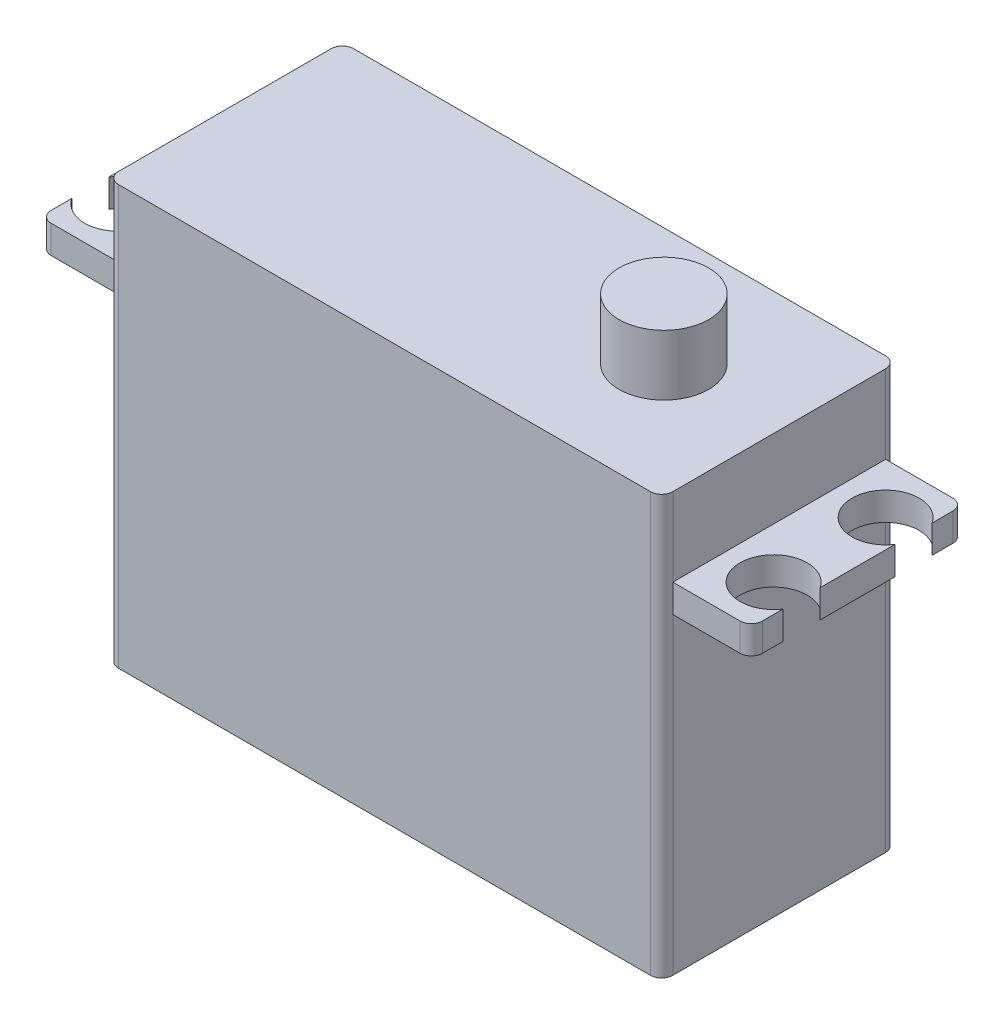
ISO-10303-21;
HEADER;
FILE_DESCRIPTION(('STEP AP214'),'2;1');
FILE_NAME('part.step','',(''),(''),'','','');
FILE_SCHEMA(('AUTOMOTIVE_DESIGN { 1 0 10303 214 1 1 1 1 }'));
ENDSEC;
DATA;
#1=APPLICATION_CONTEXT('core data for automotive mechanical design processes');
#2=APPLICATION_PROTOCOL_DEFINITION('international standard','automotive_design',2000,#1);
#3=PRODUCT_CONTEXT('',#1,'mechanical');
#4=PRODUCT('Part','Part','',(#3));
#5=PRODUCT_RELATED_PRODUCT_CATEGORY('part','',(#4));
#6=PRODUCT_DEFINITION_FORMATION('','',#4);
#7=PRODUCT_DEFINITION_CONTEXT('part definition',#1,'design');
#8=PRODUCT_DEFINITION('design','',#6,#7);
#9=PRODUCT_DEFINITION_SHAPE('','',#8);
#10=(LENGTH_UNIT() NAMED_UNIT(*) SI_UNIT(.MILLI.,.METRE.));
#11=(NAMED_UNIT(*) PLANE_ANGLE_UNIT() SI_UNIT($,.RADIAN.));
#12=(NAMED_UNIT(*) SI_UNIT($,.STERADIAN.) SOLID_ANGLE_UNIT());
#13=UNCERTAINTY_MEASURE_WITH_UNIT(LENGTH_MEASURE(1.E-05),#10,'distance_accuracy_value','');
#14=(GEOMETRIC_REPRESENTATION_CONTEXT(3) GLOBAL_UNCERTAINTY_ASSIGNED_CONTEXT((#13)) GLOBAL_UNIT_ASSIGNED_CONTEXT((#10,
#11,#12)) REPRESENTATION_CONTEXT('',''));
#15=CARTESIAN_POINT('',(0.,0.,0.));
#16=DIRECTION('',(0.,0.,1.));
#17=DIRECTION('',(1.,0.,0.));
#18=AXIS2_PLACEMENT_3D('',#15,#16,#17);
#19=CARTESIAN_POINT('',(-24.75,30.4,-10.5));
#20=DIRECTION('',(1.,0.,0.));
#21=DIRECTION('',(0.,0.,-1.));
#22=AXIS2_PLACEMENT_3D('',#19,#20,#21);
#23=PLANE('',#22);
#24=DIRECTION('',(0.,0.,1.));
#25=VECTOR('',#24,1.);
#26=CARTESIAN_POINT('',(-24.75,37.4,-10.5));
#27=LINE('',#26,#25);
#28=CARTESIAN_POINT('',(-24.75,37.4,-9.49999999999999));
#29=VERTEX_POINT('',#28);
#30=CARTESIAN_POINT('',(-24.75,37.4,9.5));
#31=VERTEX_POINT('',#30);
#32=EDGE_CURVE('E311',#29,#31,#27,.T.);
#33=ORIENTED_EDGE('',*,*,#32,.F.);
#34=DIRECTION('',(0.,-1.,0.));
#35=VECTOR('',#34,1.);
#36=CARTESIAN_POINT('',(-24.75,30.4,-9.49999999999999));
#37=LINE('',#36,#35);
#38=CARTESIAN_POINT('',(-24.75,30.4,-9.5));
#39=VERTEX_POINT('',#38);
#40=EDGE_CURVE('E453',#29,#39,#37,.T.);
#41=ORIENTED_EDGE('',*,*,#40,.T.);
#42=DIRECTION('',(0.,0.,1.));
#43=VECTOR('',#42,1.);
#44=CARTESIAN_POINT('',(-24.75,30.4,-9.5));
#45=LINE('',#44,#43);
#46=CARTESIAN_POINT('',(-24.75,30.4,9.5));
#47=VERTEX_POINT('',#46);
#48=EDGE_CURVE('E277',#39,#47,#45,.T.);
#49=ORIENTED_EDGE('',*,*,#48,.T.);
#50=DIRECTION('',(0.,-1.,0.));
#51=VECTOR('',#50,1.);
#52=CARTESIAN_POINT('',(-24.75,30.4,9.5));
#53=LINE('',#52,#51);
#54=EDGE_CURVE('E439',#47,#31,#53,.F.);
#55=ORIENTED_EDGE('',*,*,#54,.T.);
#56=EDGE_LOOP('',(#33,#41,#49,#55));
#57=FACE_BOUND('',#56,.T.);
#58=ADVANCED_FACE('F38',(#57),#23,.F.);
#59=CARTESIAN_POINT('',(24.75,30.4,10.5));
#60=DIRECTION('',(-1.,0.,0.));
#61=DIRECTION('',(0.,0.,1.));
#62=AXIS2_PLACEMENT_3D('',#59,#60,#61);
#63=PLANE('',#62);
#64=DIRECTION('',(0.,0.,-1.));
#65=VECTOR('',#64,1.);
#66=CARTESIAN_POINT('',(24.75,37.4,10.5));
#67=LINE('',#66,#65);
#68=CARTESIAN_POINT('',(24.75,37.4,9.5));
#69=VERTEX_POINT('',#68);
#70=CARTESIAN_POINT('',(24.75,37.4,-9.5));
#71=VERTEX_POINT('',#70);
#72=EDGE_CURVE('E317',#69,#71,#67,.T.);
#73=ORIENTED_EDGE('',*,*,#72,.F.);
#74=DIRECTION('',(0.,-1.,0.));
#75=VECTOR('',#74,1.);
#76=CARTESIAN_POINT('',(24.75,30.4,9.5));
#77=LINE('',#76,#75);
#78=CARTESIAN_POINT('',(24.75,30.4,9.5));
#79=VERTEX_POINT('',#78);
#80=EDGE_CURVE('E416',#69,#79,#77,.T.);
#81=ORIENTED_EDGE('',*,*,#80,.T.);
#82=DIRECTION('',(0.,0.,-1.));
#83=VECTOR('',#82,1.);
#84=CARTESIAN_POINT('',(24.75,30.4,10.5));
#85=LINE('',#84,#83);
#86=CARTESIAN_POINT('',(24.75,30.4,-9.49999999999999));
#87=VERTEX_POINT('',#86);
#88=EDGE_CURVE('E321',#79,#87,#85,.T.);
#89=ORIENTED_EDGE('',*,*,#88,.T.);
#90=DIRECTION('',(0.,-1.,0.));
#91=VECTOR('',#90,1.);
#92=CARTESIAN_POINT('',(24.75,30.4,-9.5));
#93=LINE('',#92,#91);
#94=EDGE_CURVE('E402',#87,#71,#93,.F.);
#95=ORIENTED_EDGE('',*,*,#94,.T.);
#96=EDGE_LOOP('',(#73,#81,#89,#95));
#97=FACE_BOUND('',#96,.T.);
#98=ADVANCED_FACE('F588',(#97),#63,.F.);
#99=CARTESIAN_POINT('',(-31.75,0.,0.));
#100=DIRECTION('',(-1.,0.,0.));
#101=DIRECTION('',(0.,0.,-1.));
#102=AXIS2_PLACEMENT_3D('',#99,#100,#101);
#103=PLANE('',#102);
#104=DIRECTION('',(0.,0.,1.));
#105=VECTOR('',#104,1.);
#106=CARTESIAN_POINT('',(-31.75,30.4,-9.5));
#107=LINE('',#106,#105);
#108=CARTESIAN_POINT('',(-31.75,30.4,-3.3416876048223));
#109=VERTEX_POINT('',#108);
#110=CARTESIAN_POINT('',(-31.75,30.4,3.34168760482231));
#111=VERTEX_POINT('',#110);
#112=EDGE_CURVE('E244',#109,#111,#107,.T.);
#113=ORIENTED_EDGE('',*,*,#112,.F.);
#114=DIRECTION('',(0.,1.,0.));
#115=VECTOR('',#114,1.);
#116=CARTESIAN_POINT('',(-31.75,23.4,-3.3416876048223));
#117=LINE('',#116,#115);
#118=CARTESIAN_POINT('',(-31.75,27.9,-3.3416876048223));
#119=VERTEX_POINT('',#118);
#120=EDGE_CURVE('E390',#109,#119,#117,.F.);
#121=ORIENTED_EDGE('',*,*,#120,.T.);
#122=DIRECTION('',(0.,0.,-1.));
#123=VECTOR('',#122,1.);
#124=CARTESIAN_POINT('',(-31.75,27.9,9.5));
#125=LINE('',#124,#123);
#126=CARTESIAN_POINT('',(-31.75,27.9,3.34168760482231));
#127=VERTEX_POINT('',#126);
#128=EDGE_CURVE('E257',#127,#119,#125,.T.);
#129=ORIENTED_EDGE('',*,*,#128,.F.);
#130=DIRECTION('',(0.,1.,0.));
#131=VECTOR('',#130,1.);
#132=CARTESIAN_POINT('',(-31.75,23.4,3.34168760482231));
#133=LINE('',#132,#131);
#134=EDGE_CURVE('E234',#127,#111,#133,.T.);
#135=ORIENTED_EDGE('',*,*,#134,.T.);
#136=EDGE_LOOP('',(#113,#121,#129,#135));
#137=FACE_BOUND('',#136,.T.);
#138=ADVANCED_FACE('F595',(#137),#103,.T.);
#139=CARTESIAN_POINT('',(-31.75,30.4,-8.5));
#140=VERTEX_POINT('',#139);
#141=CARTESIAN_POINT('',(-31.75,30.4,-6.6583123951777));
#142=VERTEX_POINT('',#141);
#143=EDGE_CURVE('E254',#140,#142,#107,.T.);
#144=ORIENTED_EDGE('',*,*,#143,.F.);
#145=DIRECTION('',(0.,1.,0.));
#146=VECTOR('',#145,1.);
#147=CARTESIAN_POINT('',(-31.75,0.,-8.50000000000004));
#148=LINE('',#147,#146);
#149=CARTESIAN_POINT('',(-31.75,27.9,-8.5));
#150=VERTEX_POINT('',#149);
#151=EDGE_CURVE('E472',#140,#150,#148,.F.);
#152=ORIENTED_EDGE('',*,*,#151,.T.);
#153=CARTESIAN_POINT('',(-31.75,27.9,-6.6583123951777));
#154=VERTEX_POINT('',#153);
#155=EDGE_CURVE('E259',#154,#150,#125,.T.);
#156=ORIENTED_EDGE('',*,*,#155,.F.);
#157=DIRECTION('',(0.,1.,0.));
#158=VECTOR('',#157,1.);
#159=CARTESIAN_POINT('',(-31.75,23.4,-6.6583123951777));
#160=LINE('',#159,#158);
#161=EDGE_CURVE('E233',#154,#142,#160,.T.);
#162=ORIENTED_EDGE('',*,*,#161,.T.);
#163=EDGE_LOOP('',(#144,#152,#156,#162));
#164=FACE_BOUND('',#163,.T.);
#165=ADVANCED_FACE('F743',(#164),#103,.T.);
#166=CARTESIAN_POINT('',(-31.75,27.9,8.5));
#167=VERTEX_POINT('',#166);
#168=CARTESIAN_POINT('',(-31.75,27.9,6.6583123951777));
#169=VERTEX_POINT('',#168);
#170=EDGE_CURVE('E252',#167,#169,#125,.T.);
#171=ORIENTED_EDGE('',*,*,#170,.F.);
#172=DIRECTION('',(0.,-1.,0.));
#173=VECTOR('',#172,1.);
#174=CARTESIAN_POINT('',(-31.75,0.,8.5));
#175=LINE('',#174,#173);
#176=CARTESIAN_POINT('',(-31.75,30.4,8.5));
#177=VERTEX_POINT('',#176);
#178=EDGE_CURVE('E250',#167,#177,#175,.F.);
#179=ORIENTED_EDGE('',*,*,#178,.T.);
#180=CARTESIAN_POINT('',(-31.75,30.4,6.6583123951777));
#181=VERTEX_POINT('',#180);
#182=EDGE_CURVE('E240',#181,#177,#107,.T.);
#183=ORIENTED_EDGE('',*,*,#182,.F.);
#184=DIRECTION('',(0.,1.,0.));
#185=VECTOR('',#184,1.);
#186=CARTESIAN_POINT('',(-31.75,23.4,6.6583123951777));
#187=LINE('',#186,#185);
#188=EDGE_CURVE('E222',#181,#169,#187,.F.);
#189=ORIENTED_EDGE('',*,*,#188,.T.);
#190=EDGE_LOOP('',(#171,#179,#183,#189));
#191=FACE_BOUND('',#190,.T.);
#192=ADVANCED_FACE('F248',(#191),#103,.T.);
#193=CARTESIAN_POINT('',(31.75,0.,0.));
#194=DIRECTION('',(1.,0.,0.));
#195=DIRECTION('',(0.,0.,-1.));
#196=AXIS2_PLACEMENT_3D('',#193,#194,#195);
#197=PLANE('',#196);
#198=DIRECTION('',(0.,0.,-1.));
#199=VECTOR('',#198,1.);
#200=CARTESIAN_POINT('',(31.75,27.9,9.5));
#201=LINE('',#200,#199);
#202=CARTESIAN_POINT('',(31.75,27.9,-6.6583123951777));
#203=VERTEX_POINT('',#202);
#204=CARTESIAN_POINT('',(31.75,27.9,-8.5));
#205=VERTEX_POINT('',#204);
#206=EDGE_CURVE('E330',#203,#205,#201,.T.);
#207=ORIENTED_EDGE('',*,*,#206,.T.);
#208=DIRECTION('',(0.,1.,0.));
#209=VECTOR('',#208,1.);
#210=CARTESIAN_POINT('',(31.75,30.4,-8.5));
#211=LINE('',#210,#209);
#212=CARTESIAN_POINT('',(31.75,30.4,-8.5));
#213=VERTEX_POINT('',#212);
#214=EDGE_CURVE('E503',#205,#213,#211,.T.);
#215=ORIENTED_EDGE('',*,*,#214,.T.);
#216=DIRECTION('',(0.,0.,1.));
#217=VECTOR('',#216,1.);
#218=CARTESIAN_POINT('',(31.75,30.4,-9.5));
#219=LINE('',#218,#217);
#220=CARTESIAN_POINT('',(31.75,30.4,-6.6583123951777));
#221=VERTEX_POINT('',#220);
#222=EDGE_CURVE('E327',#213,#221,#219,.T.);
#223=ORIENTED_EDGE('',*,*,#222,.T.);
#224=DIRECTION('',(0.,1.,0.));
#225=VECTOR('',#224,1.);
#226=CARTESIAN_POINT('',(31.75,23.4,-6.6583123951777));
#227=LINE('',#226,#225);
#228=EDGE_CURVE('E381',#203,#221,#227,.T.);
#229=ORIENTED_EDGE('',*,*,#228,.F.);
#230=EDGE_LOOP('',(#207,#215,#223,#229));
#231=FACE_BOUND('',#230,.T.);
#232=ADVANCED_FACE('F562',(#231),#197,.T.);
#233=DIRECTION('',(0.,1.,0.));
#234=VECTOR('',#233,1.);
#235=CARTESIAN_POINT('',(31.75,23.4,-3.3416876048223));
#236=LINE('',#235,#234);
#237=CARTESIAN_POINT('',(31.75,30.4,-3.3416876048223));
#238=VERTEX_POINT('',#237);
#239=CARTESIAN_POINT('',(31.75,27.9,-3.3416876048223));
#240=VERTEX_POINT('',#239);
#241=EDGE_CURVE('E378',#238,#240,#236,.F.);
#242=ORIENTED_EDGE('',*,*,#241,.F.);
#243=CARTESIAN_POINT('',(31.75,30.4,3.34168760482231));
#244=VERTEX_POINT('',#243);
#245=EDGE_CURVE('E331',#238,#244,#219,.T.);
#246=ORIENTED_EDGE('',*,*,#245,.T.);
#247=DIRECTION('',(0.,1.,0.));
#248=VECTOR('',#247,1.);
#249=CARTESIAN_POINT('',(31.75,23.4,3.34168760482231));
#250=LINE('',#249,#248);
#251=CARTESIAN_POINT('',(31.75,27.9,3.34168760482231));
#252=VERTEX_POINT('',#251);
#253=EDGE_CURVE('E375',#252,#244,#250,.T.);
#254=ORIENTED_EDGE('',*,*,#253,.F.);
#255=EDGE_CURVE('E337',#252,#240,#201,.T.);
#256=ORIENTED_EDGE('',*,*,#255,.T.);
#257=EDGE_LOOP('',(#242,#246,#254,#256));
#258=FACE_BOUND('',#257,.T.);
#259=ADVANCED_FACE('F571',(#258),#197,.T.);
#260=DIRECTION('',(0.,0.,-1.));
#261=VECTOR('',#260,1.);
#262=CARTESIAN_POINT('',(24.75,27.9,9.5));
#263=LINE('',#262,#261);
#264=CARTESIAN_POINT('',(24.75,27.9,9.5));
#265=VERTEX_POINT('',#264);
#266=CARTESIAN_POINT('',(24.75,27.9,-9.5));
#267=VERTEX_POINT('',#266);
#268=EDGE_CURVE('E345',#265,#267,#263,.T.);
#269=ORIENTED_EDGE('',*,*,#268,.F.);
#270=DIRECTION('',(0.,-1.,0.));
#271=VECTOR('',#270,1.);
#272=CARTESIAN_POINT('',(24.75,30.4,9.5));
#273=LINE('',#272,#271);
#274=CARTESIAN_POINT('',(24.75,0.,9.5));
#275=VERTEX_POINT('',#274);
#276=EDGE_CURVE('E413',#265,#275,#273,.T.);
#277=ORIENTED_EDGE('',*,*,#276,.T.);
#278=DIRECTION('',(0.,0.,-1.));
#279=VECTOR('',#278,1.);
#280=CARTESIAN_POINT('',(24.75,0.,10.5));
#281=LINE('',#280,#279);
#282=CARTESIAN_POINT('',(24.75,0.,-9.5));
#283=VERTEX_POINT('',#282);
#284=EDGE_CURVE('E326',#275,#283,#281,.T.);
#285=ORIENTED_EDGE('',*,*,#284,.T.);
#286=DIRECTION('',(0.,-1.,0.));
#287=VECTOR('',#286,1.);
#288=CARTESIAN_POINT('',(24.75,30.4,-9.5));
#289=LINE('',#288,#287);
#290=EDGE_CURVE('E406',#283,#267,#289,.F.);
#291=ORIENTED_EDGE('',*,*,#290,.T.);
#292=EDGE_LOOP('',(#269,#277,#285,#291));
#293=FACE_BOUND('',#292,.T.);
#294=ADVANCED_FACE('F545',(#293),#63,.F.);
#295=CARTESIAN_POINT('',(24.75,30.4,-10.5));
#296=DIRECTION('',(0.,0.,1.));
#297=DIRECTION('',(1.,0.,0.));
#298=AXIS2_PLACEMENT_3D('',#295,#296,#297);
#299=PLANE('',#298);
#300=DIRECTION('',(-1.,0.,0.));
#301=VECTOR('',#300,1.);
#302=CARTESIAN_POINT('',(24.75,0.,-10.5));
#303=LINE('',#302,#301);
#304=CARTESIAN_POINT('',(23.75,0.,-10.5));
#305=VERTEX_POINT('',#304);
#306=CARTESIAN_POINT('',(-23.75,0.,-10.5));
#307=VERTEX_POINT('',#306);
#308=EDGE_CURVE('E360',#305,#307,#303,.T.);
#309=ORIENTED_EDGE('',*,*,#308,.T.);
#310=DIRECTION('',(0.,-1.,0.));
#311=VECTOR('',#310,1.);
#312=CARTESIAN_POINT('',(-23.75,30.4,-10.5));
#313=LINE('',#312,#311);
#314=CARTESIAN_POINT('',(-23.75,37.4,-10.5));
#315=VERTEX_POINT('',#314);
#316=EDGE_CURVE('E460',#307,#315,#313,.F.);
#317=ORIENTED_EDGE('',*,*,#316,.T.);
#318=DIRECTION('',(-1.,0.,0.));
#319=VECTOR('',#318,1.);
#320=CARTESIAN_POINT('',(24.75,37.4,-10.5));
#321=LINE('',#320,#319);
#322=CARTESIAN_POINT('',(23.75,37.4,-10.5));
#323=VERTEX_POINT('',#322);
#324=EDGE_CURVE('E307',#323,#315,#321,.T.);
#325=ORIENTED_EDGE('',*,*,#324,.F.);
#326=DIRECTION('',(0.,-1.,0.));
#327=VECTOR('',#326,1.);
#328=CARTESIAN_POINT('',(23.75,30.4,-10.5));
#329=LINE('',#328,#327);
#330=EDGE_CURVE('E394',#323,#305,#329,.T.);
#331=ORIENTED_EDGE('',*,*,#330,.T.);
#332=EDGE_LOOP('',(#309,#317,#325,#331));
#333=FACE_BOUND('',#332,.T.);
#334=ADVANCED_FACE('F603',(#333),#299,.F.);
#335=DIRECTION('',(0.,0.,-1.));
#336=VECTOR('',#335,1.);
#337=CARTESIAN_POINT('',(-24.75,27.9,9.5));
#338=LINE('',#337,#336);
#339=CARTESIAN_POINT('',(-24.75,27.9,9.5));
#340=VERTEX_POINT('',#339);
#341=CARTESIAN_POINT('',(-24.75,27.9,-9.5));
#342=VERTEX_POINT('',#341);
#343=EDGE_CURVE('E613',#340,#342,#338,.T.);
#344=ORIENTED_EDGE('',*,*,#343,.T.);
#345=DIRECTION('',(0.,-1.,0.));
#346=VECTOR('',#345,1.);
#347=CARTESIAN_POINT('',(-24.75,30.4,-9.49999999999999));
#348=LINE('',#347,#346);
#349=CARTESIAN_POINT('',(-24.75,0.,-9.49999999999999));
#350=VERTEX_POINT('',#349);
#351=EDGE_CURVE('E450',#342,#350,#348,.T.);
#352=ORIENTED_EDGE('',*,*,#351,.T.);
#353=DIRECTION('',(0.,0.,1.));
#354=VECTOR('',#353,1.);
#355=CARTESIAN_POINT('',(-24.75,0.,-10.5));
#356=LINE('',#355,#354);
#357=CARTESIAN_POINT('',(-24.75,0.,9.5));
#358=VERTEX_POINT('',#357);
#359=EDGE_CURVE('E364',#350,#358,#356,.T.);
#360=ORIENTED_EDGE('',*,*,#359,.T.);
#361=DIRECTION('',(0.,-1.,0.));
#362=VECTOR('',#361,1.);
#363=CARTESIAN_POINT('',(-24.75,30.4,9.5));
#364=LINE('',#363,#362);
#365=EDGE_CURVE('E443',#358,#340,#364,.F.);
#366=ORIENTED_EDGE('',*,*,#365,.T.);
#367=EDGE_LOOP('',(#344,#352,#360,#366));
#368=FACE_BOUND('',#367,.T.);
#369=ADVANCED_FACE('F591',(#368),#23,.F.);
#370=CARTESIAN_POINT('',(-24.75,30.4,10.5));
#371=DIRECTION('',(0.,0.,-1.));
#372=DIRECTION('',(-1.,0.,0.));
#373=AXIS2_PLACEMENT_3D('',#370,#371,#372);
#374=PLANE('',#373);
#375=DIRECTION('',(1.,0.,0.));
#376=VECTOR('',#375,1.);
#377=CARTESIAN_POINT('',(-24.75,37.4,10.5));
#378=LINE('',#377,#376);
#379=CARTESIAN_POINT('',(-23.75,37.4,10.5));
#380=VERTEX_POINT('',#379);
#381=CARTESIAN_POINT('',(23.75,37.4,10.5));
#382=VERTEX_POINT('',#381);
#383=EDGE_CURVE('E314',#380,#382,#378,.T.);
#384=ORIENTED_EDGE('',*,*,#383,.F.);
#385=DIRECTION('',(0.,-1.,0.));
#386=VECTOR('',#385,1.);
#387=CARTESIAN_POINT('',(-23.75,30.4,10.5));
#388=LINE('',#387,#386);
#389=CARTESIAN_POINT('',(-23.75,0.,10.5));
#390=VERTEX_POINT('',#389);
#391=EDGE_CURVE('E431',#380,#390,#388,.T.);
#392=ORIENTED_EDGE('',*,*,#391,.T.);
#393=DIRECTION('',(1.,0.,0.));
#394=VECTOR('',#393,1.);
#395=CARTESIAN_POINT('',(-24.75,0.,10.5));
#396=LINE('',#395,#394);
#397=CARTESIAN_POINT('',(23.75,0.,10.5));
#398=VERTEX_POINT('',#397);
#399=EDGE_CURVE('E367',#390,#398,#396,.T.);
#400=ORIENTED_EDGE('',*,*,#399,.T.);
#401=DIRECTION('',(0.,-1.,0.));
#402=VECTOR('',#401,1.);
#403=CARTESIAN_POINT('',(23.75,30.4,10.5));
#404=LINE('',#403,#402);
#405=EDGE_CURVE('E424',#398,#382,#404,.F.);
#406=ORIENTED_EDGE('',*,*,#405,.T.);
#407=EDGE_LOOP('',(#384,#392,#400,#406));
#408=FACE_BOUND('',#407,.T.);
#409=ADVANCED_FACE('F602',(#408),#374,.F.);
#410=CARTESIAN_POINT('',(0.,30.4,0.));
#411=DIRECTION('',(0.,1.,0.));
#412=DIRECTION('',(0.,0.,1.));
#413=AXIS2_PLACEMENT_3D('',#410,#411,#412);
#414=PLANE('',#413);
#415=ORIENTED_EDGE('',*,*,#222,.F.);
#416=CARTESIAN_POINT('',(30.75,30.4,-8.5));
#417=DIRECTION('',(0.,1.,0.));
#418=DIRECTION('',(0.,0.,1.));
#419=AXIS2_PLACEMENT_3D('',#416,#417,#418);
#420=CIRCLE('',#419,1.);
#421=CARTESIAN_POINT('',(30.75,30.4,-9.5));
#422=VERTEX_POINT('',#421);
#423=EDGE_CURVE('E61',#213,#422,#420,.T.);
#424=ORIENTED_EDGE('',*,*,#423,.T.);
#425=DIRECTION('',(-1.,0.,0.));
#426=VECTOR('',#425,1.);
#427=CARTESIAN_POINT('',(31.75,30.4,-9.5));
#428=LINE('',#427,#426);
#429=EDGE_CURVE('E357',#422,#87,#428,.T.);
#430=ORIENTED_EDGE('',*,*,#429,.T.);
#431=ORIENTED_EDGE('',*,*,#88,.F.);
#432=DIRECTION('',(-1.,0.,0.));
#433=VECTOR('',#432,1.);
#434=CARTESIAN_POINT('',(31.75,30.4,9.5));
#435=LINE('',#434,#433);
#436=CARTESIAN_POINT('',(30.75,30.4,9.5));
#437=VERTEX_POINT('',#436);
#438=EDGE_CURVE('E354',#437,#79,#435,.T.);
#439=ORIENTED_EDGE('',*,*,#438,.F.);
#440=CARTESIAN_POINT('',(30.75,30.4,8.5));
#441=DIRECTION('',(0.,1.,0.));
#442=DIRECTION('',(0.,0.,1.));
#443=AXIS2_PLACEMENT_3D('',#440,#441,#442);
#444=CIRCLE('',#443,1.);
#445=CARTESIAN_POINT('',(31.75,30.4,8.5));
#446=VERTEX_POINT('',#445);
#447=EDGE_CURVE('E500',#437,#446,#444,.T.);
#448=ORIENTED_EDGE('',*,*,#447,.T.);
#449=CARTESIAN_POINT('',(31.75,30.4,6.6583123951777));
#450=VERTEX_POINT('',#449);
#451=EDGE_CURVE('E332',#450,#446,#219,.T.);
#452=ORIENTED_EDGE('',*,*,#451,.F.);
#453=CARTESIAN_POINT('',(29.25,30.4,5.00000000000001));
#454=DIRECTION('',(0.,1.,0.));
#455=DIRECTION('',(0.,0.,-1.));
#456=AXIS2_PLACEMENT_3D('',#453,#454,#455);
#457=CIRCLE('',#456,3.);
#458=EDGE_CURVE('E290',#244,#450,#457,.T.);
#459=ORIENTED_EDGE('',*,*,#458,.F.);
#460=ORIENTED_EDGE('',*,*,#245,.F.);
#461=CARTESIAN_POINT('',(29.25,30.4,-5.));
#462=DIRECTION('',(0.,1.,0.));
#463=DIRECTION('',(0.,0.,1.));
#464=AXIS2_PLACEMENT_3D('',#461,#462,#463);
#465=CIRCLE('',#464,3.);
#466=EDGE_CURVE('E294',#221,#238,#465,.T.);
#467=ORIENTED_EDGE('',*,*,#466,.F.);
#468=EDGE_LOOP('',(#415,#424,#430,#431,#439,#448,#452,#459,#460,#467));
#469=FACE_BOUND('',#468,.T.);
#470=ADVANCED_FACE('F565',(#469),#414,.T.);
#471=CARTESIAN_POINT('',(0.,0.,0.));
#472=DIRECTION('',(0.,1.,0.));
#473=DIRECTION('',(0.,0.,1.));
#474=AXIS2_PLACEMENT_3D('',#471,#472,#473);
#475=PLANE('',#474);
#476=ORIENTED_EDGE('',*,*,#359,.F.);
#477=CARTESIAN_POINT('',(-23.75,0.,-9.49999999999999));
#478=DIRECTION('',(0.,1.,0.));
#479=DIRECTION('',(0.,0.,1.));
#480=AXIS2_PLACEMENT_3D('',#477,#478,#479);
#481=CIRCLE('',#480,1.);
#482=EDGE_CURVE('E457',#350,#307,#481,.F.);
#483=ORIENTED_EDGE('',*,*,#482,.T.);
#484=ORIENTED_EDGE('',*,*,#308,.F.);
#485=CARTESIAN_POINT('',(23.75,0.,-9.5));
#486=DIRECTION('',(0.,1.,0.));
#487=DIRECTION('',(0.,0.,1.));
#488=AXIS2_PLACEMENT_3D('',#485,#486,#487);
#489=CIRCLE('',#488,1.);
#490=EDGE_CURVE('E398',#305,#283,#489,.F.);
#491=ORIENTED_EDGE('',*,*,#490,.T.);
#492=ORIENTED_EDGE('',*,*,#284,.F.);
#493=CARTESIAN_POINT('',(23.75,0.,9.5));
#494=DIRECTION('',(0.,1.,0.));
#495=DIRECTION('',(0.,0.,1.));
#496=AXIS2_PLACEMENT_3D('',#493,#494,#495);
#497=CIRCLE('',#496,1.);
#498=EDGE_CURVE('E420',#275,#398,#497,.F.);
#499=ORIENTED_EDGE('',*,*,#498,.T.);
#500=ORIENTED_EDGE('',*,*,#399,.F.);
#501=CARTESIAN_POINT('',(-23.75,0.,9.49999999999999));
#502=DIRECTION('',(0.,1.,0.));
#503=DIRECTION('',(0.,0.,1.));
#504=AXIS2_PLACEMENT_3D('',#501,#502,#503);
#505=CIRCLE('',#504,1.);
#506=EDGE_CURVE('E435',#390,#358,#505,.F.);
#507=ORIENTED_EDGE('',*,*,#506,.T.);
#508=EDGE_LOOP('',(#476,#483,#484,#491,#492,#499,#500,#507));
#509=FACE_BOUND('',#508,.T.);
#510=ADVANCED_FACE('F548',(#509),#475,.F.);
#511=CARTESIAN_POINT('',(31.75,27.9,-9.5));
#512=DIRECTION('',(0.,0.,1.));
#513=DIRECTION('',(0.,-1.,0.));
#514=AXIS2_PLACEMENT_3D('',#511,#512,#513);
#515=PLANE('',#514);
#516=ORIENTED_EDGE('',*,*,#429,.F.);
#517=DIRECTION('',(0.,1.,0.));
#518=VECTOR('',#517,1.);
#519=CARTESIAN_POINT('',(30.75,27.9,-9.5));
#520=LINE('',#519,#518);
#521=CARTESIAN_POINT('',(30.75,27.9,-9.5));
#522=VERTEX_POINT('',#521);
#523=EDGE_CURVE('E47',#422,#522,#520,.F.);
#524=ORIENTED_EDGE('',*,*,#523,.T.);
#525=DIRECTION('',(-1.,0.,0.));
#526=VECTOR('',#525,1.);
#527=CARTESIAN_POINT('',(31.75,27.9,-9.5));
#528=LINE('',#527,#526);
#529=EDGE_CURVE('E336',#522,#267,#528,.T.);
#530=ORIENTED_EDGE('',*,*,#529,.T.);
#531=DIRECTION('',(0.,1.,0.));
#532=VECTOR('',#531,1.);
#533=CARTESIAN_POINT('',(24.75,27.9,-9.5));
#534=LINE('',#533,#532);
#535=EDGE_CURVE('E320',#267,#87,#534,.T.);
#536=ORIENTED_EDGE('',*,*,#535,.T.);
#537=EDGE_LOOP('',(#516,#524,#530,#536));
#538=FACE_BOUND('',#537,.T.);
#539=ADVANCED_FACE('F634',(#538),#515,.F.);
#540=CARTESIAN_POINT('',(31.75,30.4,9.5));
#541=DIRECTION('',(0.,0.,-1.));
#542=DIRECTION('',(-1.,0.,0.));
#543=AXIS2_PLACEMENT_3D('',#540,#541,#542);
#544=PLANE('',#543);
#545=DIRECTION('',(-1.,0.,0.));
#546=VECTOR('',#545,1.);
#547=CARTESIAN_POINT('',(31.75,27.9,9.5));
#548=LINE('',#547,#546);
#549=CARTESIAN_POINT('',(30.75,27.9,9.5));
#550=VERTEX_POINT('',#549);
#551=EDGE_CURVE('E351',#550,#265,#548,.T.);
#552=ORIENTED_EDGE('',*,*,#551,.F.);
#553=DIRECTION('',(0.,-1.,0.));
#554=VECTOR('',#553,1.);
#555=CARTESIAN_POINT('',(30.75,30.4,9.5));
#556=LINE('',#555,#554);
#557=EDGE_CURVE('E497',#550,#437,#556,.F.);
#558=ORIENTED_EDGE('',*,*,#557,.T.);
#559=ORIENTED_EDGE('',*,*,#438,.T.);
#560=DIRECTION('',(0.,-1.,0.));
#561=VECTOR('',#560,1.);
#562=CARTESIAN_POINT('',(24.75,30.4,9.5));
#563=LINE('',#562,#561);
#564=EDGE_CURVE('E341',#79,#265,#563,.T.);
#565=ORIENTED_EDGE('',*,*,#564,.T.);
#566=EDGE_LOOP('',(#552,#558,#559,#565));
#567=FACE_BOUND('',#566,.T.);
#568=ADVANCED_FACE('F533',(#567),#544,.F.);
#569=CARTESIAN_POINT('',(31.75,27.9,9.5));
#570=DIRECTION('',(0.,1.,0.));
#571=DIRECTION('',(0.,0.,1.));
#572=AXIS2_PLACEMENT_3D('',#569,#570,#571);
#573=PLANE('',#572);
#574=ORIENTED_EDGE('',*,*,#529,.F.);
#575=CARTESIAN_POINT('',(30.75,27.9,-8.5));
#576=DIRECTION('',(0.,1.,0.));
#577=DIRECTION('',(0.,0.,1.));
#578=AXIS2_PLACEMENT_3D('',#575,#576,#577);
#579=CIRCLE('',#578,1.);
#580=EDGE_CURVE('E11',#522,#205,#579,.F.);
#581=ORIENTED_EDGE('',*,*,#580,.T.);
#582=ORIENTED_EDGE('',*,*,#206,.F.);
#583=CARTESIAN_POINT('',(29.25,27.9,-5.));
#584=DIRECTION('',(0.,1.,0.));
#585=DIRECTION('',(0.,0.,1.));
#586=AXIS2_PLACEMENT_3D('',#583,#584,#585);
#587=CIRCLE('',#586,3.);
#588=EDGE_CURVE('E303',#203,#240,#587,.T.);
#589=ORIENTED_EDGE('',*,*,#588,.T.);
#590=ORIENTED_EDGE('',*,*,#255,.F.);
#591=CARTESIAN_POINT('',(29.25,27.9,5.00000000000001));
#592=DIRECTION('',(0.,1.,0.));
#593=DIRECTION('',(0.,0.,1.));
#594=AXIS2_PLACEMENT_3D('',#591,#592,#593);
#595=CIRCLE('',#594,3.);
#596=CARTESIAN_POINT('',(31.75,27.9,6.6583123951777));
#597=VERTEX_POINT('',#596);
#598=EDGE_CURVE('E297',#252,#597,#595,.T.);
#599=ORIENTED_EDGE('',*,*,#598,.T.);
#600=CARTESIAN_POINT('',(31.75,27.9,8.5));
#601=VERTEX_POINT('',#600);
#602=EDGE_CURVE('E333',#601,#597,#201,.T.);
#603=ORIENTED_EDGE('',*,*,#602,.F.);
#604=CARTESIAN_POINT('',(30.75,27.9,8.5));
#605=DIRECTION('',(0.,1.,0.));
#606=DIRECTION('',(0.,0.,1.));
#607=AXIS2_PLACEMENT_3D('',#604,#605,#606);
#608=CIRCLE('',#607,1.);
#609=EDGE_CURVE('E494',#601,#550,#608,.F.);
#610=ORIENTED_EDGE('',*,*,#609,.T.);
#611=ORIENTED_EDGE('',*,*,#551,.T.);
#612=ORIENTED_EDGE('',*,*,#268,.T.);
#613=EDGE_LOOP('',(#574,#581,#582,#589,#590,#599,#603,#610,#611,#612));
#614=FACE_BOUND('',#613,.T.);
#615=ADVANCED_FACE('F530',(#614),#573,.F.);
#616=ORIENTED_EDGE('',*,*,#451,.T.);
#617=DIRECTION('',(0.,-1.,0.));
#618=VECTOR('',#617,1.);
#619=CARTESIAN_POINT('',(31.75,27.9,8.5));
#620=LINE('',#619,#618);
#621=EDGE_CURVE('E490',#446,#601,#620,.T.);
#622=ORIENTED_EDGE('',*,*,#621,.T.);
#623=ORIENTED_EDGE('',*,*,#602,.T.);
#624=DIRECTION('',(0.,1.,0.));
#625=VECTOR('',#624,1.);
#626=CARTESIAN_POINT('',(31.75,23.4,6.6583123951777));
#627=LINE('',#626,#625);
#628=EDGE_CURVE('E325',#450,#597,#627,.F.);
#629=ORIENTED_EDGE('',*,*,#628,.F.);
#630=EDGE_LOOP('',(#616,#622,#623,#629));
#631=FACE_BOUND('',#630,.T.);
#632=ADVANCED_FACE('F521',(#631),#197,.T.);
#633=CARTESIAN_POINT('',(0.,37.4,0.));
#634=DIRECTION('',(0.,1.,0.));
#635=DIRECTION('',(0.,0.,1.));
#636=AXIS2_PLACEMENT_3D('',#633,#634,#635);
#637=PLANE('',#636);
#638=CARTESIAN_POINT('',(14.45,37.4,0.));
#639=DIRECTION('',(0.,1.,0.));
#640=DIRECTION('',(0.,0.,1.));
#641=AXIS2_PLACEMENT_3D('',#638,#639,#640);
#642=CIRCLE('',#641,4.);
#643=CARTESIAN_POINT('',(14.45,37.4,-4.));
#644=VERTEX_POINT('',#643);
#645=EDGE_CURVE('E285',#644,#644,#642,.T.);
#646=ORIENTED_EDGE('',*,*,#645,.F.);
#647=EDGE_LOOP('',(#646));
#648=FACE_BOUND('',#647,.T.);
#649=ORIENTED_EDGE('',*,*,#324,.T.);
#650=CARTESIAN_POINT('',(-23.75,37.4,-9.49999999999999));
#651=DIRECTION('',(0.,1.,0.));
#652=DIRECTION('',(0.,0.,1.));
#653=AXIS2_PLACEMENT_3D('',#650,#651,#652);
#654=CIRCLE('',#653,1.);
#655=EDGE_CURVE('E463',#315,#29,#654,.T.);
#656=ORIENTED_EDGE('',*,*,#655,.T.);
#657=ORIENTED_EDGE('',*,*,#32,.T.);
#658=CARTESIAN_POINT('',(-23.75,37.4,9.49999999999999));
#659=DIRECTION('',(0.,1.,0.));
#660=DIRECTION('',(0.,0.,1.));
#661=AXIS2_PLACEMENT_3D('',#658,#659,#660);
#662=CIRCLE('',#661,1.);
#663=EDGE_CURVE('E447',#31,#380,#662,.T.);
#664=ORIENTED_EDGE('',*,*,#663,.T.);
#665=ORIENTED_EDGE('',*,*,#383,.T.);
#666=CARTESIAN_POINT('',(23.75,37.4,9.5));
#667=DIRECTION('',(0.,1.,0.));
#668=DIRECTION('',(0.,0.,1.));
#669=AXIS2_PLACEMENT_3D('',#666,#667,#668);
#670=CIRCLE('',#669,1.);
#671=EDGE_CURVE('E428',#382,#69,#670,.T.);
#672=ORIENTED_EDGE('',*,*,#671,.T.);
#673=ORIENTED_EDGE('',*,*,#72,.T.);
#674=CARTESIAN_POINT('',(23.75,37.4,-9.5));
#675=DIRECTION('',(0.,1.,0.));
#676=DIRECTION('',(0.,0.,1.));
#677=AXIS2_PLACEMENT_3D('',#674,#675,#676);
#678=CIRCLE('',#677,1.);
#679=EDGE_CURVE('E410',#71,#323,#678,.T.);
#680=ORIENTED_EDGE('',*,*,#679,.T.);
#681=EDGE_LOOP('',(#649,#656,#657,#664,#665,#672,#673,#680));
#682=FACE_BOUND('',#681,.T.);
#683=ADVANCED_FACE('F577',(#648,#682),#637,.T.);
#684=CARTESIAN_POINT('',(29.25,23.4,5.00000000000001));
#685=DIRECTION('',(0.,1.,0.));
#686=DIRECTION('',(0.,0.,1.));
#687=AXIS2_PLACEMENT_3D('',#684,#685,#686);
#688=CYLINDRICAL_SURFACE('',#687,3.);
#689=ORIENTED_EDGE('',*,*,#253,.T.);
#690=ORIENTED_EDGE('',*,*,#458,.T.);
#691=ORIENTED_EDGE('',*,*,#628,.T.);
#692=ORIENTED_EDGE('',*,*,#598,.F.);
#693=EDGE_LOOP('',(#689,#690,#691,#692));
#694=FACE_BOUND('',#693,.T.);
#695=ADVANCED_FACE('F575',(#694),#688,.F.);
#696=CARTESIAN_POINT('',(29.25,23.4,-5.));
#697=DIRECTION('',(0.,1.,0.));
#698=DIRECTION('',(0.,0.,1.));
#699=AXIS2_PLACEMENT_3D('',#696,#697,#698);
#700=CYLINDRICAL_SURFACE('',#699,3.);
#701=ORIENTED_EDGE('',*,*,#228,.T.);
#702=ORIENTED_EDGE('',*,*,#466,.T.);
#703=ORIENTED_EDGE('',*,*,#241,.T.);
#704=ORIENTED_EDGE('',*,*,#588,.F.);
#705=EDGE_LOOP('',(#701,#702,#703,#704));
#706=FACE_BOUND('',#705,.T.);
#707=ADVANCED_FACE('F569',(#706),#700,.F.);
#708=CARTESIAN_POINT('',(14.45,42.8,0.));
#709=DIRECTION('',(0.,-1.,0.));
#710=DIRECTION('',(0.,0.,-1.));
#711=AXIS2_PLACEMENT_3D('',#708,#709,#710);
#712=CYLINDRICAL_SURFACE('',#711,4.);
#713=CARTESIAN_POINT('',(14.45,42.8,0.));
#714=DIRECTION('',(0.,1.,0.));
#715=DIRECTION('',(0.,0.,1.));
#716=AXIS2_PLACEMENT_3D('',#713,#714,#715);
#717=CIRCLE('',#716,4.);
#718=CARTESIAN_POINT('',(14.45,42.8,-4.));
#719=VERTEX_POINT('',#718);
#720=EDGE_CURVE('E286',#719,#719,#717,.T.);
#721=CARTESIAN_POINT('',(14.45,42.8,-4.));
#722=CARTESIAN_POINT('',(14.45,42.74375,-4.));
#723=CARTESIAN_POINT('',(14.45,42.6875,-4.));
#724=CARTESIAN_POINT('',(14.45,42.575,-4.));
#725=CARTESIAN_POINT('',(14.45,42.51875,-4.));
#726=CARTESIAN_POINT('',(14.45,42.40625,-4.));
#727=CARTESIAN_POINT('',(14.45,42.35,-4.));
#728=CARTESIAN_POINT('',(14.45,42.2375,-4.));
#729=CARTESIAN_POINT('',(14.45,42.18125,-4.));
#730=CARTESIAN_POINT('',(14.45,42.06875,-4.));
#731=CARTESIAN_POINT('',(14.45,42.0125,-4.));
#732=CARTESIAN_POINT('',(14.45,41.9,-4.));
#733=CARTESIAN_POINT('',(14.45,41.84375,-4.));
#734=CARTESIAN_POINT('',(14.45,41.73125,-4.));
#735=CARTESIAN_POINT('',(14.45,41.675,-4.));
#736=CARTESIAN_POINT('',(14.45,41.5625,-4.));
#737=CARTESIAN_POINT('',(14.45,41.50625,-4.));
#738=CARTESIAN_POINT('',(14.45,41.39375,-4.));
#739=CARTESIAN_POINT('',(14.45,41.3375,-4.));
#740=CARTESIAN_POINT('',(14.45,41.225,-4.));
#741=CARTESIAN_POINT('',(14.45,41.16875,-4.));
#742=CARTESIAN_POINT('',(14.45,41.05625,-4.));
#743=CARTESIAN_POINT('',(14.45,41.,-4.));
#744=CARTESIAN_POINT('',(14.45,40.8875,-4.));
#745=CARTESIAN_POINT('',(14.45,40.83125,-4.));
#746=CARTESIAN_POINT('',(14.45,40.71875,-4.));
#747=CARTESIAN_POINT('',(14.45,40.6625,-4.));
#748=CARTESIAN_POINT('',(14.45,40.55,-4.));
#749=CARTESIAN_POINT('',(14.45,40.49375,-4.));
#750=CARTESIAN_POINT('',(14.45,40.38125,-4.));
#751=CARTESIAN_POINT('',(14.45,40.325,-4.));
#752=CARTESIAN_POINT('',(14.45,40.2125,-4.));
#753=CARTESIAN_POINT('',(14.45,40.15625,-4.));
#754=CARTESIAN_POINT('',(14.45,40.04375,-4.));
#755=CARTESIAN_POINT('',(14.45,39.9875,-4.));
#756=CARTESIAN_POINT('',(14.45,39.875,-4.));
#757=CARTESIAN_POINT('',(14.45,39.81875,-4.));
#758=CARTESIAN_POINT('',(14.45,39.70625,-4.));
#759=CARTESIAN_POINT('',(14.45,39.65,-4.));
#760=CARTESIAN_POINT('',(14.45,39.5375,-4.));
#761=CARTESIAN_POINT('',(14.45,39.48125,-4.));
#762=CARTESIAN_POINT('',(14.45,39.36875,-4.));
#763=CARTESIAN_POINT('',(14.45,39.3125,-4.));
#764=CARTESIAN_POINT('',(14.45,39.2,-4.));
#765=CARTESIAN_POINT('',(14.45,39.14375,-4.));
#766=CARTESIAN_POINT('',(14.45,39.03125,-4.));
#767=CARTESIAN_POINT('',(14.45,38.975,-4.));
#768=CARTESIAN_POINT('',(14.45,38.8625,-4.));
#769=CARTESIAN_POINT('',(14.45,38.80625,-4.));
#770=CARTESIAN_POINT('',(14.45,38.69375,-4.));
#771=CARTESIAN_POINT('',(14.45,38.6375,-4.));
#772=CARTESIAN_POINT('',(14.45,38.525,-4.));
#773=CARTESIAN_POINT('',(14.45,38.46875,-4.));
#774=CARTESIAN_POINT('',(14.45,38.35625,-4.));
#775=CARTESIAN_POINT('',(14.45,38.3,-4.));
#776=CARTESIAN_POINT('',(14.45,38.1875,-4.));
#777=CARTESIAN_POINT('',(14.45,38.13125,-4.));
#778=CARTESIAN_POINT('',(14.45,38.01875,-4.));
#779=CARTESIAN_POINT('',(14.45,37.9625,-4.));
#780=CARTESIAN_POINT('',(14.45,37.85,-4.));
#781=CARTESIAN_POINT('',(14.45,37.79375,-4.));
#782=CARTESIAN_POINT('',(14.45,37.68125,-4.));
#783=CARTESIAN_POINT('',(14.45,37.625,-4.));
#784=CARTESIAN_POINT('',(14.45,37.5125,-4.));
#785=CARTESIAN_POINT('',(14.45,37.45625,-4.));
#786=CARTESIAN_POINT('',(14.45,37.4,-4.));
#787=B_SPLINE_CURVE_WITH_KNOTS('',3,(#721,#722,#723,#724,#725,#726,#727,#728,#729,#730,#731,
#732,#733,#734,#735,#736,#737,#738,#739,#740,#741,#742,#743,#744,#745,#746,#747,#748,#749,#750,
#751,#752,#753,#754,#755,#756,#757,#758,#759,#760,#761,#762,#763,#764,#765,#766,#767,#768,#769,
#770,#771,#772,#773,#774,#775,#776,#777,#778,#779,#780,#781,#782,#783,#784,#785,#786),
.UNSPECIFIED.,.F.,.F.,(4,2,2,2,2,2,2,2,2,2,2,2,2,2,2,2,2,2,2,2,2,2,2,2,2,2,2,2,2,2,2,2,4),(0.,
0.168749999999995,0.337499999999998,0.50625,0.674999999999995,0.843749999999997,1.0125,
1.18124999999999,1.35,1.51875,1.68749999999999,1.85625,2.025,2.19375,2.3625,2.53125,2.7,2.86875,
3.0375,3.20625,3.375,3.54375,3.7125,3.88125,4.05,4.21875,4.3875,4.55625,4.725,4.89375,5.0625,
5.23125,5.4),.UNSPECIFIED.);
#788=EDGE_CURVE('BSEAM583',#719,#644,#787,.T.);
#789=ORIENTED_EDGE('',*,*,#720,.F.);
#790=ORIENTED_EDGE('',*,*,#645,.T.);
#791=ORIENTED_EDGE('',*,*,#788,.T.);
#792=ORIENTED_EDGE('',*,*,#788,.F.);
#793=EDGE_LOOP('',(#789,#791,#790,#792));
#794=FACE_BOUND('',#793,.T.);
#795=ADVANCED_FACE('F583',(#794),#712,.T.);
#796=CARTESIAN_POINT('',(14.45,42.8,0.));
#797=DIRECTION('',(0.,1.,0.));
#798=DIRECTION('',(0.,0.,1.));
#799=AXIS2_PLACEMENT_3D('',#796,#797,#798);
#800=PLANE('',#799);
#801=ORIENTED_EDGE('',*,*,#720,.T.);
#802=EDGE_LOOP('',(#801));
#803=FACE_BOUND('',#802,.T.);
#804=ADVANCED_FACE('F762',(#803),#800,.T.);
#805=CARTESIAN_POINT('',(-31.75,27.9,-9.5));
#806=DIRECTION('',(0.,0.,-1.));
#807=DIRECTION('',(0.,1.,0.));
#808=AXIS2_PLACEMENT_3D('',#805,#806,#807);
#809=PLANE('',#808);
#810=DIRECTION('',(1.,0.,0.));
#811=VECTOR('',#810,1.);
#812=CARTESIAN_POINT('',(-31.75,27.9,-9.5));
#813=LINE('',#812,#811);
#814=CARTESIAN_POINT('',(-30.75,27.9,-9.5));
#815=VERTEX_POINT('',#814);
#816=EDGE_CURVE('E282',#815,#342,#813,.T.);
#817=ORIENTED_EDGE('',*,*,#816,.F.);
#818=DIRECTION('',(0.,1.,0.));
#819=VECTOR('',#818,1.);
#820=CARTESIAN_POINT('',(-30.75,27.9,-9.5));
#821=LINE('',#820,#819);
#822=CARTESIAN_POINT('',(-30.75,30.4,-9.5));
#823=VERTEX_POINT('',#822);
#824=EDGE_CURVE('E466',#815,#823,#821,.T.);
#825=ORIENTED_EDGE('',*,*,#824,.T.);
#826=DIRECTION('',(1.,0.,0.));
#827=VECTOR('',#826,1.);
#828=CARTESIAN_POINT('',(-31.75,30.4,-9.5));
#829=LINE('',#828,#827);
#830=EDGE_CURVE('E262',#823,#39,#829,.T.);
#831=ORIENTED_EDGE('',*,*,#830,.T.);
#832=DIRECTION('',(0.,1.,0.));
#833=VECTOR('',#832,1.);
#834=CARTESIAN_POINT('',(-24.75,27.9,-9.5));
#835=LINE('',#834,#833);
#836=EDGE_CURVE('E621',#342,#39,#835,.T.);
#837=ORIENTED_EDGE('',*,*,#836,.F.);
#838=EDGE_LOOP('',(#817,#825,#831,#837));
#839=FACE_BOUND('',#838,.T.);
#840=ADVANCED_FACE('F756',(#839),#809,.T.);
#841=CARTESIAN_POINT('',(-31.75,27.9,9.5));
#842=DIRECTION('',(0.,-1.,0.));
#843=DIRECTION('',(0.,0.,-1.));
#844=AXIS2_PLACEMENT_3D('',#841,#842,#843);
#845=PLANE('',#844);
#846=DIRECTION('',(1.,0.,0.));
#847=VECTOR('',#846,1.);
#848=CARTESIAN_POINT('',(-31.75,27.9,9.5));
#849=LINE('',#848,#847);
#850=CARTESIAN_POINT('',(-30.75,27.9,9.5));
#851=VERTEX_POINT('',#850);
#852=EDGE_CURVE('E274',#851,#340,#849,.T.);
#853=ORIENTED_EDGE('',*,*,#852,.F.);
#854=CARTESIAN_POINT('',(-30.75,27.9,8.5));
#855=DIRECTION('',(0.,-1.,0.));
#856=DIRECTION('',(0.,0.,-1.));
#857=AXIS2_PLACEMENT_3D('',#854,#855,#856);
#858=CIRCLE('',#857,1.);
#859=EDGE_CURVE('E482',#851,#167,#858,.T.);
#860=ORIENTED_EDGE('',*,*,#859,.T.);
#861=ORIENTED_EDGE('',*,*,#170,.T.);
#862=CARTESIAN_POINT('',(-29.25,27.9,5.00000000000001));
#863=DIRECTION('',(0.,-1.,0.));
#864=DIRECTION('',(0.,0.,-1.));
#865=AXIS2_PLACEMENT_3D('',#862,#863,#864);
#866=CIRCLE('',#865,3.);
#867=EDGE_CURVE('E228',#169,#127,#866,.F.);
#868=ORIENTED_EDGE('',*,*,#867,.T.);
#869=ORIENTED_EDGE('',*,*,#128,.T.);
#870=CARTESIAN_POINT('',(-29.25,27.9,-5.));
#871=DIRECTION('',(0.,-1.,0.));
#872=DIRECTION('',(0.,0.,-1.));
#873=AXIS2_PLACEMENT_3D('',#870,#871,#872);
#874=CIRCLE('',#873,3.);
#875=EDGE_CURVE('E925',#119,#154,#874,.F.);
#876=ORIENTED_EDGE('',*,*,#875,.T.);
#877=ORIENTED_EDGE('',*,*,#155,.T.);
#878=CARTESIAN_POINT('',(-30.75,27.9,-8.5));
#879=DIRECTION('',(0.,-1.,0.));
#880=DIRECTION('',(0.,0.,-1.));
#881=AXIS2_PLACEMENT_3D('',#878,#879,#880);
#882=CIRCLE('',#881,1.);
#883=EDGE_CURVE('E475',#150,#815,#882,.T.);
#884=ORIENTED_EDGE('',*,*,#883,.T.);
#885=ORIENTED_EDGE('',*,*,#816,.T.);
#886=ORIENTED_EDGE('',*,*,#343,.F.);
#887=EDGE_LOOP('',(#853,#860,#861,#868,#869,#876,#877,#884,#885,#886));
#888=FACE_BOUND('',#887,.T.);
#889=ADVANCED_FACE('F761',(#888),#845,.T.);
#890=CARTESIAN_POINT('',(-31.75,30.4,9.5));
#891=DIRECTION('',(0.,0.,1.));
#892=DIRECTION('',(1.,0.,0.));
#893=AXIS2_PLACEMENT_3D('',#890,#891,#892);
#894=PLANE('',#893);
#895=DIRECTION('',(1.,0.,0.));
#896=VECTOR('',#895,1.);
#897=CARTESIAN_POINT('',(-31.75,30.4,9.5));
#898=LINE('',#897,#896);
#899=CARTESIAN_POINT('',(-30.75,30.4,9.5));
#900=VERTEX_POINT('',#899);
#901=EDGE_CURVE('E266',#900,#47,#898,.T.);
#902=ORIENTED_EDGE('',*,*,#901,.F.);
#903=DIRECTION('',(0.,-1.,0.));
#904=VECTOR('',#903,1.);
#905=CARTESIAN_POINT('',(-30.75,30.4,9.5));
#906=LINE('',#905,#904);
#907=EDGE_CURVE('E478',#900,#851,#906,.T.);
#908=ORIENTED_EDGE('',*,*,#907,.T.);
#909=ORIENTED_EDGE('',*,*,#852,.T.);
#910=DIRECTION('',(0.,-1.,0.));
#911=VECTOR('',#910,1.);
#912=CARTESIAN_POINT('',(-24.75,30.4,9.5));
#913=LINE('',#912,#911);
#914=EDGE_CURVE('E620',#47,#340,#913,.T.);
#915=ORIENTED_EDGE('',*,*,#914,.F.);
#916=EDGE_LOOP('',(#902,#908,#909,#915));
#917=FACE_BOUND('',#916,.T.);
#918=ADVANCED_FACE('F786',(#917),#894,.T.);
#919=CARTESIAN_POINT('',(-31.75,30.4,-9.5));
#920=DIRECTION('',(0.,1.,0.));
#921=DIRECTION('',(0.,0.,1.));
#922=AXIS2_PLACEMENT_3D('',#919,#920,#921);
#923=PLANE('',#922);
#924=ORIENTED_EDGE('',*,*,#182,.T.);
#925=CARTESIAN_POINT('',(-30.75,30.4,8.5));
#926=DIRECTION('',(0.,1.,0.));
#927=DIRECTION('',(0.,0.,1.));
#928=AXIS2_PLACEMENT_3D('',#925,#926,#927);
#929=CIRCLE('',#928,1.);
#930=EDGE_CURVE('E487',#177,#900,#929,.T.);
#931=ORIENTED_EDGE('',*,*,#930,.T.);
#932=ORIENTED_EDGE('',*,*,#901,.T.);
#933=ORIENTED_EDGE('',*,*,#48,.F.);
#934=ORIENTED_EDGE('',*,*,#830,.F.);
#935=CARTESIAN_POINT('',(-30.75,30.4,-8.5));
#936=DIRECTION('',(0.,1.,0.));
#937=DIRECTION('',(0.,0.,1.));
#938=AXIS2_PLACEMENT_3D('',#935,#936,#937);
#939=CIRCLE('',#938,1.);
#940=EDGE_CURVE('E469',#823,#140,#939,.T.);
#941=ORIENTED_EDGE('',*,*,#940,.T.);
#942=ORIENTED_EDGE('',*,*,#143,.T.);
#943=CARTESIAN_POINT('',(-29.25,30.4,-5.));
#944=DIRECTION('',(0.,-1.,0.));
#945=DIRECTION('',(0.,0.,1.));
#946=AXIS2_PLACEMENT_3D('',#943,#944,#945);
#947=CIRCLE('',#946,3.);
#948=EDGE_CURVE('E246',#142,#109,#947,.T.);
#949=ORIENTED_EDGE('',*,*,#948,.T.);
#950=ORIENTED_EDGE('',*,*,#112,.T.);
#951=CARTESIAN_POINT('',(-29.25,30.4,5.00000000000001));
#952=DIRECTION('',(0.,-1.,0.));
#953=DIRECTION('',(0.,0.,-1.));
#954=AXIS2_PLACEMENT_3D('',#951,#952,#953);
#955=CIRCLE('',#954,3.);
#956=EDGE_CURVE('E225',#111,#181,#955,.T.);
#957=ORIENTED_EDGE('',*,*,#956,.T.);
#958=EDGE_LOOP('',(#924,#931,#932,#933,#934,#941,#942,#949,#950,#957));
#959=FACE_BOUND('',#958,.T.);
#960=ADVANCED_FACE('F239',(#959),#923,.T.);
#961=CARTESIAN_POINT('',(-29.25,23.4,5.00000000000001));
#962=DIRECTION('',(0.,1.,0.));
#963=DIRECTION('',(0.,0.,1.));
#964=AXIS2_PLACEMENT_3D('',#961,#962,#963);
#965=CYLINDRICAL_SURFACE('',#964,3.);
#966=ORIENTED_EDGE('',*,*,#956,.F.);
#967=ORIENTED_EDGE('',*,*,#134,.F.);
#968=ORIENTED_EDGE('',*,*,#867,.F.);
#969=ORIENTED_EDGE('',*,*,#188,.F.);
#970=EDGE_LOOP('',(#966,#967,#968,#969));
#971=FACE_BOUND('',#970,.T.);
#972=ADVANCED_FACE('F224',(#971),#965,.F.);
#973=CARTESIAN_POINT('',(-29.25,23.4,-5.));
#974=DIRECTION('',(0.,1.,0.));
#975=DIRECTION('',(0.,0.,1.));
#976=AXIS2_PLACEMENT_3D('',#973,#974,#975);
#977=CYLINDRICAL_SURFACE('',#976,3.);
#978=ORIENTED_EDGE('',*,*,#948,.F.);
#979=ORIENTED_EDGE('',*,*,#161,.F.);
#980=ORIENTED_EDGE('',*,*,#875,.F.);
#981=ORIENTED_EDGE('',*,*,#120,.F.);
#982=EDGE_LOOP('',(#978,#979,#980,#981));
#983=FACE_BOUND('',#982,.T.);
#984=ADVANCED_FACE('F809',(#983),#977,.F.);
#985=CARTESIAN_POINT('',(23.75,30.4,-9.5));
#986=DIRECTION('',(0.,-1.,0.));
#987=DIRECTION('',(0.,0.,-1.));
#988=AXIS2_PLACEMENT_3D('',#985,#986,#987);
#989=CYLINDRICAL_SURFACE('',#988,1.);
#990=ORIENTED_EDGE('',*,*,#535,.F.);
#991=ORIENTED_EDGE('',*,*,#290,.F.);
#992=ORIENTED_EDGE('',*,*,#490,.F.);
#993=ORIENTED_EDGE('',*,*,#330,.F.);
#994=ORIENTED_EDGE('',*,*,#679,.F.);
#995=ORIENTED_EDGE('',*,*,#94,.F.);
#996=EDGE_LOOP('',(#990,#991,#992,#993,#994,#995));
#997=FACE_BOUND('',#996,.T.);
#998=ADVANCED_FACE('F555',(#997),#989,.T.);
#999=CARTESIAN_POINT('',(23.75,30.4,9.5));
#1000=DIRECTION('',(0.,-1.,0.));
#1001=DIRECTION('',(0.,0.,-1.));
#1002=AXIS2_PLACEMENT_3D('',#999,#1000,#1001);
#1003=CYLINDRICAL_SURFACE('',#1002,1.);
#1004=ORIENTED_EDGE('',*,*,#671,.F.);
#1005=ORIENTED_EDGE('',*,*,#405,.F.);
#1006=ORIENTED_EDGE('',*,*,#498,.F.);
#1007=ORIENTED_EDGE('',*,*,#276,.F.);
#1008=ORIENTED_EDGE('',*,*,#564,.F.);
#1009=ORIENTED_EDGE('',*,*,#80,.F.);
#1010=EDGE_LOOP('',(#1004,#1005,#1006,#1007,#1008,#1009));
#1011=FACE_BOUND('',#1010,.T.);
#1012=ADVANCED_FACE('F541',(#1011),#1003,.T.);
#1013=CARTESIAN_POINT('',(-23.75,30.4,9.49999999999999));
#1014=DIRECTION('',(0.,-1.,0.));
#1015=DIRECTION('',(0.,0.,-1.));
#1016=AXIS2_PLACEMENT_3D('',#1013,#1014,#1015);
#1017=CYLINDRICAL_SURFACE('',#1016,1.);
#1018=ORIENTED_EDGE('',*,*,#914,.T.);
#1019=ORIENTED_EDGE('',*,*,#365,.F.);
#1020=ORIENTED_EDGE('',*,*,#506,.F.);
#1021=ORIENTED_EDGE('',*,*,#391,.F.);
#1022=ORIENTED_EDGE('',*,*,#663,.F.);
#1023=ORIENTED_EDGE('',*,*,#54,.F.);
#1024=EDGE_LOOP('',(#1018,#1019,#1020,#1021,#1022,#1023));
#1025=FACE_BOUND('',#1024,.T.);
#1026=ADVANCED_FACE('F734',(#1025),#1017,.T.);
#1027=CARTESIAN_POINT('',(-23.75,30.4,-9.49999999999999));
#1028=DIRECTION('',(0.,-1.,0.));
#1029=DIRECTION('',(0.,0.,-1.));
#1030=AXIS2_PLACEMENT_3D('',#1027,#1028,#1029);
#1031=CYLINDRICAL_SURFACE('',#1030,1.);
#1032=ORIENTED_EDGE('',*,*,#655,.F.);
#1033=ORIENTED_EDGE('',*,*,#316,.F.);
#1034=ORIENTED_EDGE('',*,*,#482,.F.);
#1035=ORIENTED_EDGE('',*,*,#351,.F.);
#1036=ORIENTED_EDGE('',*,*,#836,.T.);
#1037=ORIENTED_EDGE('',*,*,#40,.F.);
#1038=EDGE_LOOP('',(#1032,#1033,#1034,#1035,#1036,#1037));
#1039=FACE_BOUND('',#1038,.T.);
#1040=ADVANCED_FACE('F626',(#1039),#1031,.T.);
#1041=CARTESIAN_POINT('',(-30.75,27.9,-8.5));
#1042=DIRECTION('',(0.,1.,0.));
#1043=DIRECTION('',(0.,0.,1.));
#1044=AXIS2_PLACEMENT_3D('',#1041,#1042,#1043);
#1045=CYLINDRICAL_SURFACE('',#1044,1.);
#1046=ORIENTED_EDGE('',*,*,#883,.F.);
#1047=ORIENTED_EDGE('',*,*,#151,.F.);
#1048=ORIENTED_EDGE('',*,*,#940,.F.);
#1049=ORIENTED_EDGE('',*,*,#824,.F.);
#1050=EDGE_LOOP('',(#1046,#1047,#1048,#1049));
#1051=FACE_BOUND('',#1050,.T.);
#1052=ADVANCED_FACE('F733',(#1051),#1045,.T.);
#1053=CARTESIAN_POINT('',(-30.75,30.4,8.5));
#1054=DIRECTION('',(0.,-1.,0.));
#1055=DIRECTION('',(0.,0.,-1.));
#1056=AXIS2_PLACEMENT_3D('',#1053,#1054,#1055);
#1057=CYLINDRICAL_SURFACE('',#1056,1.);
#1058=ORIENTED_EDGE('',*,*,#930,.F.);
#1059=ORIENTED_EDGE('',*,*,#178,.F.);
#1060=ORIENTED_EDGE('',*,*,#859,.F.);
#1061=ORIENTED_EDGE('',*,*,#907,.F.);
#1062=EDGE_LOOP('',(#1058,#1059,#1060,#1061));
#1063=FACE_BOUND('',#1062,.T.);
#1064=ADVANCED_FACE('F671',(#1063),#1057,.T.);
#1065=CARTESIAN_POINT('',(30.75,0.,8.5));
#1066=DIRECTION('',(0.,1.,0.));
#1067=DIRECTION('',(0.,0.,1.));
#1068=AXIS2_PLACEMENT_3D('',#1065,#1066,#1067);
#1069=CYLINDRICAL_SURFACE('',#1068,1.);
#1070=ORIENTED_EDGE('',*,*,#447,.F.);
#1071=ORIENTED_EDGE('',*,*,#557,.F.);
#1072=ORIENTED_EDGE('',*,*,#609,.F.);
#1073=ORIENTED_EDGE('',*,*,#621,.F.);
#1074=EDGE_LOOP('',(#1070,#1071,#1072,#1073));
#1075=FACE_BOUND('',#1074,.T.);
#1076=ADVANCED_FACE('F526',(#1075),#1069,.T.);
#1077=CARTESIAN_POINT('',(30.75,0.,-8.50000000000004));
#1078=DIRECTION('',(0.,-1.,0.));
#1079=DIRECTION('',(0.,0.,-1.));
#1080=AXIS2_PLACEMENT_3D('',#1077,#1078,#1079);
#1081=CYLINDRICAL_SURFACE('',#1080,1.);
#1082=ORIENTED_EDGE('',*,*,#580,.F.);
#1083=ORIENTED_EDGE('',*,*,#523,.F.);
#1084=ORIENTED_EDGE('',*,*,#423,.F.);
#1085=ORIENTED_EDGE('',*,*,#214,.F.);
#1086=EDGE_LOOP('',(#1082,#1083,#1084,#1085));
#1087=FACE_BOUND('',#1086,.T.);
#1088=ADVANCED_FACE('F40',(#1087),#1081,.T.);
#1089=CLOSED_SHELL('',(#58,#98,#138,#165,#192,#232,#259,#294,#334,#369,#409,#470,#510,#539,#568,
#615,#632,#683,#695,#707,#795,#804,#840,#889,#918,#960,#972,#984,#998,#1012,#1026,#1040,#1052,
#1064,#1076,#1088));
#1090=MANIFOLD_SOLID_BREP('B2',#1089);
#1091=ADVANCED_BREP_SHAPE_REPRESENTATION('',(#18,#1090),#14);
#1092=SHAPE_DEFINITION_REPRESENTATION(#9,#1091);
ENDSEC;
END-ISO-10303-21;
